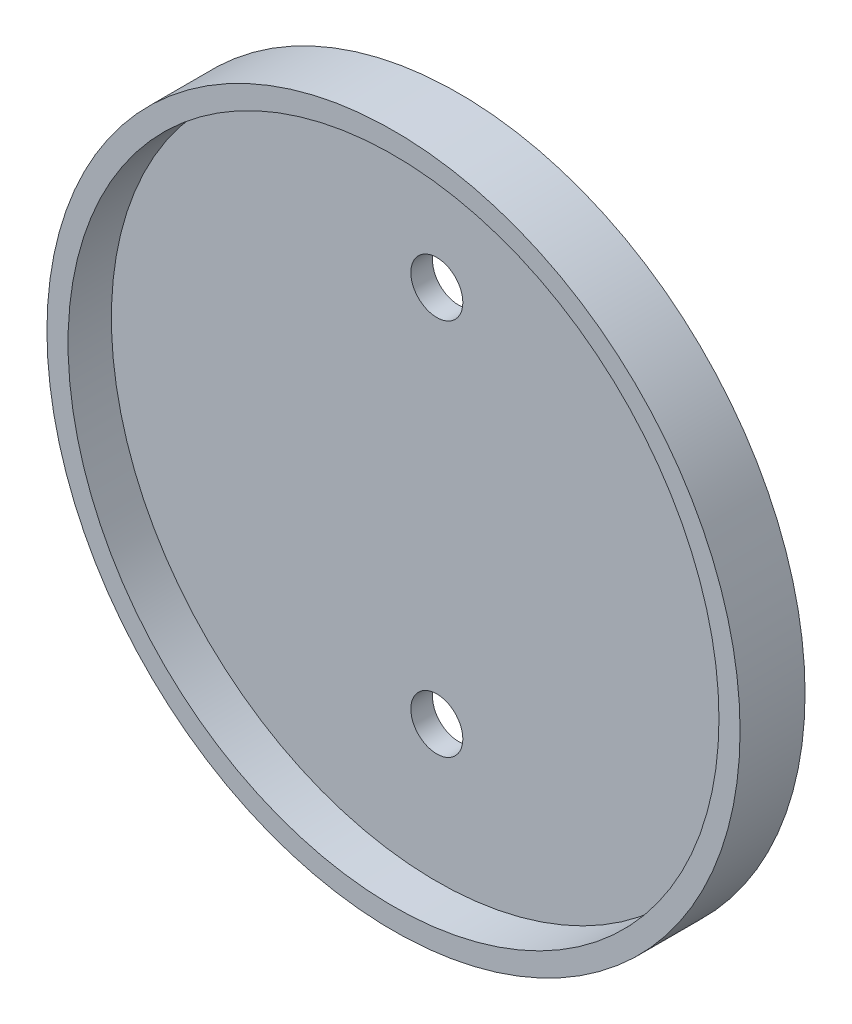
ISO-10303-21;
HEADER;
FILE_DESCRIPTION(('STEP AP214'),'2;1');
FILE_NAME('part.step','',(''),(''),'','','');
FILE_SCHEMA(('AUTOMOTIVE_DESIGN { 1 0 10303 214 1 1 1 1 }'));
ENDSEC;
DATA;
#1=APPLICATION_CONTEXT('core data for automotive mechanical design processes');
#2=APPLICATION_PROTOCOL_DEFINITION('international standard','automotive_design',2000,#1);
#3=PRODUCT_CONTEXT('',#1,'mechanical');
#4=PRODUCT('Part','Part','',(#3));
#5=PRODUCT_RELATED_PRODUCT_CATEGORY('part','',(#4));
#6=PRODUCT_DEFINITION_FORMATION('','',#4);
#7=PRODUCT_DEFINITION_CONTEXT('part definition',#1,'design');
#8=PRODUCT_DEFINITION('design','',#6,#7);
#9=PRODUCT_DEFINITION_SHAPE('','',#8);
#10=(LENGTH_UNIT() NAMED_UNIT(*) SI_UNIT(.MILLI.,.METRE.));
#11=(NAMED_UNIT(*) PLANE_ANGLE_UNIT() SI_UNIT($,.RADIAN.));
#12=(NAMED_UNIT(*) SI_UNIT($,.STERADIAN.) SOLID_ANGLE_UNIT());
#13=UNCERTAINTY_MEASURE_WITH_UNIT(LENGTH_MEASURE(1.E-05),#10,'distance_accuracy_value','');
#14=(GEOMETRIC_REPRESENTATION_CONTEXT(3) GLOBAL_UNCERTAINTY_ASSIGNED_CONTEXT((#13)) GLOBAL_UNIT_ASSIGNED_CONTEXT((#10,
#11,#12)) REPRESENTATION_CONTEXT('',''));
#15=CARTESIAN_POINT('',(0.,0.,0.));
#16=DIRECTION('',(0.,0.,1.));
#17=DIRECTION('',(1.,0.,0.));
#18=AXIS2_PLACEMENT_3D('',#15,#16,#17);
#19=CARTESIAN_POINT('',(0.,0.,-0.999998));
#20=DIRECTION('',(0.,0.,1.));
#21=DIRECTION('',(1.,0.,0.));
#22=AXIS2_PLACEMENT_3D('',#19,#20,#21);
#23=PLANE('',#22);
#24=CARTESIAN_POINT('',(0.,0.,-0.999998));
#25=DIRECTION('',(0.,0.,1.));
#26=DIRECTION('',(1.,0.,0.));
#27=AXIS2_PLACEMENT_3D('',#24,#25,#26);
#28=CIRCLE('',#27,32.);
#29=CARTESIAN_POINT('',(32.,0.,-0.999998));
#30=VERTEX_POINT('',#29);
#31=EDGE_CURVE('E44',#30,#30,#28,.T.);
#32=ORIENTED_EDGE('',*,*,#31,.F.);
#33=EDGE_LOOP('',(#32));
#34=FACE_BOUND('',#33,.T.);
#35=CARTESIAN_POINT('',(0.,17.4498,-0.999998000000001));
#36=DIRECTION('',(0.,0.,-1.));
#37=DIRECTION('',(-1.,0.,0.));
#38=AXIS2_PLACEMENT_3D('',#35,#36,#37);
#39=CIRCLE('',#38,2.39999999999999);
#40=CARTESIAN_POINT('',(-2.39999999999998,17.4498,-0.999998000000001));
#41=VERTEX_POINT('',#40);
#42=EDGE_CURVE('E60',#41,#41,#39,.T.);
#43=ORIENTED_EDGE('',*,*,#42,.F.);
#44=EDGE_LOOP('',(#43));
#45=FACE_BOUND('',#44,.T.);
#46=CARTESIAN_POINT('',(0.,-17.4498,-0.999998000000001));
#47=DIRECTION('',(0.,0.,-1.));
#48=DIRECTION('',(-1.,0.,0.));
#49=AXIS2_PLACEMENT_3D('',#46,#47,#48);
#50=CIRCLE('',#49,2.39999999999999);
#51=CARTESIAN_POINT('',(-2.39999999999999,-17.4498,-0.999998000000001));
#52=VERTEX_POINT('',#51);
#53=EDGE_CURVE('E66',#52,#52,#50,.T.);
#54=ORIENTED_EDGE('',*,*,#53,.F.);
#55=EDGE_LOOP('',(#54));
#56=FACE_BOUND('',#55,.T.);
#57=ADVANCED_FACE('F37',(#34,#45,#56),#23,.F.);
#58=CARTESIAN_POINT('',(0.,0.,0.999998));
#59=DIRECTION('',(0.,0.,-1.));
#60=DIRECTION('',(-1.,0.,0.));
#61=AXIS2_PLACEMENT_3D('',#58,#59,#60);
#62=CYLINDRICAL_SURFACE('',#61,32.);
#63=ORIENTED_EDGE('',*,*,#31,.T.);
#64=EDGE_LOOP('',(#63));
#65=FACE_BOUND('',#64,.T.);
#66=CARTESIAN_POINT('',(0.,0.,4.999998));
#67=DIRECTION('',(0.,0.,1.));
#68=DIRECTION('',(1.,0.,0.));
#69=AXIS2_PLACEMENT_3D('',#66,#67,#68);
#70=CIRCLE('',#69,32.);
#71=CARTESIAN_POINT('',(32.,0.,4.999998));
#72=VERTEX_POINT('',#71);
#73=EDGE_CURVE('E48',#72,#72,#70,.T.);
#74=ORIENTED_EDGE('',*,*,#73,.F.);
#75=EDGE_LOOP('',(#74));
#76=FACE_BOUND('',#75,.T.);
#77=ADVANCED_FACE('F39',(#65,#76),#62,.T.);
#78=CARTESIAN_POINT('',(0.,0.,4.999998));
#79=DIRECTION('',(0.,0.,1.));
#80=DIRECTION('',(1.,0.,0.));
#81=AXIS2_PLACEMENT_3D('',#78,#79,#80);
#82=PLANE('',#81);
#83=ORIENTED_EDGE('',*,*,#73,.T.);
#84=EDGE_LOOP('',(#83));
#85=FACE_BOUND('',#84,.T.);
#86=CARTESIAN_POINT('',(0.,0.,4.999998));
#87=DIRECTION('',(0.,0.,1.));
#88=DIRECTION('',(1.,0.,0.));
#89=AXIS2_PLACEMENT_3D('',#86,#87,#88);
#90=CIRCLE('',#89,30.05);
#91=CARTESIAN_POINT('',(30.05,0.,4.999998));
#92=VERTEX_POINT('',#91);
#93=EDGE_CURVE('E52',#92,#92,#90,.T.);
#94=ORIENTED_EDGE('',*,*,#93,.F.);
#95=EDGE_LOOP('',(#94));
#96=FACE_BOUND('',#95,.T.);
#97=ADVANCED_FACE('F78',(#85,#96),#82,.T.);
#98=CARTESIAN_POINT('',(0.,0.,4.999998));
#99=DIRECTION('',(0.,0.,-1.));
#100=DIRECTION('',(-1.,0.,0.));
#101=AXIS2_PLACEMENT_3D('',#98,#99,#100);
#102=CYLINDRICAL_SURFACE('',#101,30.05);
#103=ORIENTED_EDGE('',*,*,#93,.T.);
#104=EDGE_LOOP('',(#103));
#105=FACE_BOUND('',#104,.T.);
#106=CARTESIAN_POINT('',(0.,0.,0.999998));
#107=DIRECTION('',(0.,0.,1.));
#108=DIRECTION('',(1.,0.,0.));
#109=AXIS2_PLACEMENT_3D('',#106,#107,#108);
#110=CIRCLE('',#109,30.05);
#111=CARTESIAN_POINT('',(30.05,0.,0.999998));
#112=VERTEX_POINT('',#111);
#113=EDGE_CURVE('E10',#112,#112,#110,.F.);
#114=ORIENTED_EDGE('',*,*,#113,.T.);
#115=EDGE_LOOP('',(#114));
#116=FACE_BOUND('',#115,.T.);
#117=ADVANCED_FACE('F85',(#105,#116),#102,.F.);
#118=CARTESIAN_POINT('',(0.,0.,0.999998));
#119=DIRECTION('',(0.,0.,1.));
#120=DIRECTION('',(1.,0.,0.));
#121=AXIS2_PLACEMENT_3D('',#118,#119,#120);
#122=PLANE('',#121);
#123=CARTESIAN_POINT('',(0.,-17.4498,0.999998));
#124=DIRECTION('',(0.,0.,1.));
#125=DIRECTION('',(1.,0.,0.));
#126=AXIS2_PLACEMENT_3D('',#123,#124,#125);
#127=CIRCLE('',#126,2.39999999999999);
#128=CARTESIAN_POINT('',(2.39999999999999,-17.4498,0.999998));
#129=VERTEX_POINT('',#128);
#130=EDGE_CURVE('E63',#129,#129,#127,.T.);
#131=ORIENTED_EDGE('',*,*,#130,.F.);
#132=EDGE_LOOP('',(#131));
#133=FACE_BOUND('',#132,.T.);
#134=CARTESIAN_POINT('',(0.,17.4498,0.999998));
#135=DIRECTION('',(0.,0.,1.));
#136=DIRECTION('',(1.,0.,0.));
#137=AXIS2_PLACEMENT_3D('',#134,#135,#136);
#138=CIRCLE('',#137,2.39999999999999);
#139=CARTESIAN_POINT('',(2.4,17.4498,0.999998));
#140=VERTEX_POINT('',#139);
#141=EDGE_CURVE('E57',#140,#140,#138,.T.);
#142=ORIENTED_EDGE('',*,*,#141,.F.);
#143=EDGE_LOOP('',(#142));
#144=FACE_BOUND('',#143,.T.);
#145=ORIENTED_EDGE('',*,*,#113,.F.);
#146=EDGE_LOOP('',(#145));
#147=FACE_BOUND('',#146,.T.);
#148=ADVANCED_FACE('F81',(#133,#144,#147),#122,.T.);
#149=CARTESIAN_POINT('',(0.,17.4498,-0.999998));
#150=DIRECTION('',(0.,0.,-1.));
#151=DIRECTION('',(-1.,0.,0.));
#152=AXIS2_PLACEMENT_3D('',#149,#150,#151);
#153=CYLINDRICAL_SURFACE('',#152,2.39999999999999);
#154=ORIENTED_EDGE('',*,*,#42,.T.);
#155=EDGE_LOOP('',(#154));
#156=FACE_BOUND('',#155,.T.);
#157=ORIENTED_EDGE('',*,*,#141,.T.);
#158=EDGE_LOOP('',(#157));
#159=FACE_BOUND('',#158,.T.);
#160=ADVANCED_FACE('F84',(#156,#159),#153,.F.);
#161=CARTESIAN_POINT('',(0.,-17.4498,-0.999998));
#162=DIRECTION('',(0.,0.,-1.));
#163=DIRECTION('',(-1.,0.,0.));
#164=AXIS2_PLACEMENT_3D('',#161,#162,#163);
#165=CYLINDRICAL_SURFACE('',#164,2.39999999999999);
#166=ORIENTED_EDGE('',*,*,#53,.T.);
#167=EDGE_LOOP('',(#166));
#168=FACE_BOUND('',#167,.T.);
#169=ORIENTED_EDGE('',*,*,#130,.T.);
#170=EDGE_LOOP('',(#169));
#171=FACE_BOUND('',#170,.T.);
#172=ADVANCED_FACE('F70',(#168,#171),#165,.F.);
#173=CLOSED_SHELL('',(#57,#77,#97,#117,#148,#160,#172));
#174=MANIFOLD_SOLID_BREP('B2',#173);
#175=ADVANCED_BREP_SHAPE_REPRESENTATION('',(#18,#174),#14);
#176=SHAPE_DEFINITION_REPRESENTATION(#9,#175);
ENDSEC;
END-ISO-10303-21;
